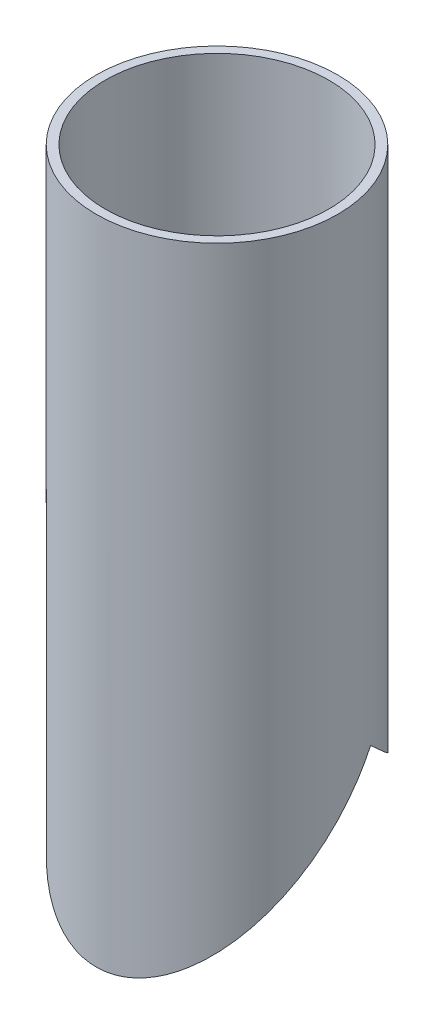
ISO-10303-21;
HEADER;
FILE_DESCRIPTION(('STEP AP214'),'2;1');
FILE_NAME('part.step','',(''),(''),'','','');
FILE_SCHEMA(('AUTOMOTIVE_DESIGN { 1 0 10303 214 1 1 1 1 }'));
ENDSEC;
DATA;
#1=APPLICATION_CONTEXT('core data for automotive mechanical design processes');
#2=APPLICATION_PROTOCOL_DEFINITION('international standard','automotive_design',2000,#1);
#3=PRODUCT_CONTEXT('',#1,'mechanical');
#4=PRODUCT('Part','Part','',(#3));
#5=PRODUCT_RELATED_PRODUCT_CATEGORY('part','',(#4));
#6=PRODUCT_DEFINITION_FORMATION('','',#4);
#7=PRODUCT_DEFINITION_CONTEXT('part definition',#1,'design');
#8=PRODUCT_DEFINITION('design','',#6,#7);
#9=PRODUCT_DEFINITION_SHAPE('','',#8);
#10=(LENGTH_UNIT() NAMED_UNIT(*) SI_UNIT(.MILLI.,.METRE.));
#11=(NAMED_UNIT(*) PLANE_ANGLE_UNIT() SI_UNIT($,.RADIAN.));
#12=(NAMED_UNIT(*) SI_UNIT($,.STERADIAN.) SOLID_ANGLE_UNIT());
#13=UNCERTAINTY_MEASURE_WITH_UNIT(LENGTH_MEASURE(1.E-05),#10,'distance_accuracy_value','');
#14=(GEOMETRIC_REPRESENTATION_CONTEXT(3) GLOBAL_UNCERTAINTY_ASSIGNED_CONTEXT((#13)) GLOBAL_UNIT_ASSIGNED_CONTEXT((#10,
#11,#12)) REPRESENTATION_CONTEXT('',''));
#15=CARTESIAN_POINT('',(0.,0.,0.));
#16=DIRECTION('',(0.,0.,1.));
#17=DIRECTION('',(1.,0.,0.));
#18=AXIS2_PLACEMENT_3D('',#15,#16,#17);
#19=CARTESIAN_POINT('',(0.,0.,0.));
#20=DIRECTION('',(0.,-1.,0.));
#21=DIRECTION('',(0.,0.,-1.));
#22=AXIS2_PLACEMENT_3D('',#19,#20,#21);
#23=CYLINDRICAL_SURFACE('',#22,22.225);
#24=CARTESIAN_POINT('',(0.,38.6546226433122,0.));
#25=DIRECTION('',(0.,0.725274725274725,-0.688459565172619));
#26=DIRECTION('',(0.,-0.688459565172619,-0.725274725274725));
#27=AXIS2_PLACEMENT_3D('',#24,#25,#26);
#28=ELLIPSE('',#27,30.6435606060606,22.225);
#29=CARTESIAN_POINT('',(-21.0009952448997,31.75,-7.27384518144986));
#30=VERTEX_POINT('',#29);
#31=CARTESIAN_POINT('',(21.0009952448997,31.75,-7.27384518144986));
#32=VERTEX_POINT('',#31);
#33=EDGE_CURVE('E11',#30,#32,#28,.F.);
#34=ORIENTED_EDGE('',*,*,#33,.F.);
#35=CARTESIAN_POINT('',(0.,24.0871882205687,0.));
#36=DIRECTION('',(0.,0.688459565172619,0.725274725274725));
#37=DIRECTION('',(0.,-0.725274725274725,0.688459565172619));
#38=AXIS2_PLACEMENT_3D('',#35,#36,#37);
#39=ELLIPSE('',#38,32.2822154332731,22.225);
#40=EDGE_CURVE('E41',#32,#30,#39,.F.);
#41=ORIENTED_EDGE('',*,*,#40,.F.);
#42=EDGE_LOOP('',(#34,#41));
#43=FACE_BOUND('',#42,.T.);
#44=CARTESIAN_POINT('',(0.,120.65,0.));
#45=DIRECTION('',(0.,-1.,0.));
#46=DIRECTION('',(0.,0.,-1.));
#47=AXIS2_PLACEMENT_3D('',#44,#45,#46);
#48=CIRCLE('',#47,22.225);
#49=CARTESIAN_POINT('',(0.,120.65,-22.225));
#50=VERTEX_POINT('',#49);
#51=EDGE_CURVE('E73',#50,#50,#48,.T.);
#52=ORIENTED_EDGE('',*,*,#51,.T.);
#53=EDGE_LOOP('',(#52));
#54=FACE_BOUND('',#53,.T.);
#55=ADVANCED_FACE('F33',(#43,#54),#23,.T.);
#56=CARTESIAN_POINT('',(0.,0.,0.));
#57=DIRECTION('',(0.,-1.,0.));
#58=DIRECTION('',(0.,0.,-1.));
#59=AXIS2_PLACEMENT_3D('',#56,#57,#58);
#60=CYLINDRICAL_SURFACE('',#59,20.574);
#61=CARTESIAN_POINT('',(0.,38.6546226433122,0.));
#62=DIRECTION('',(0.,0.725274725274725,-0.688459565172619));
#63=DIRECTION('',(0.,-0.688459565172619,-0.725274725274725));
#64=AXIS2_PLACEMENT_3D('',#61,#62,#63);
#65=ELLIPSE('',#64,28.3671818181818,20.574);
#66=CARTESIAN_POINT('',(19.2452761028856,31.75,-7.27384518144986));
#67=VERTEX_POINT('',#66);
#68=CARTESIAN_POINT('',(-19.2452761028856,31.75,-7.27384518144986));
#69=VERTEX_POINT('',#68);
#70=EDGE_CURVE('E66',#67,#69,#65,.T.);
#71=ORIENTED_EDGE('',*,*,#70,.F.);
#72=CARTESIAN_POINT('',(0.,24.0871882205687,0.));
#73=DIRECTION('',(0.,0.688459565172619,0.725274725274725));
#74=DIRECTION('',(0.,-0.725274725274725,0.688459565172619));
#75=AXIS2_PLACEMENT_3D('',#72,#73,#74);
#76=ELLIPSE('',#75,29.8841080010871,20.574);
#77=EDGE_CURVE('E68',#69,#67,#76,.T.);
#78=ORIENTED_EDGE('',*,*,#77,.F.);
#79=EDGE_LOOP('',(#71,#78));
#80=FACE_BOUND('',#79,.T.);
#81=CARTESIAN_POINT('',(0.,120.65,0.));
#82=DIRECTION('',(0.,-1.,0.));
#83=DIRECTION('',(0.,0.,-1.));
#84=AXIS2_PLACEMENT_3D('',#81,#82,#83);
#85=CIRCLE('',#84,20.574);
#86=CARTESIAN_POINT('',(0.,120.65,-20.574));
#87=VERTEX_POINT('',#86);
#88=EDGE_CURVE('E63',#87,#87,#85,.T.);
#89=ORIENTED_EDGE('',*,*,#88,.F.);
#90=EDGE_LOOP('',(#89));
#91=FACE_BOUND('',#90,.T.);
#92=ADVANCED_FACE('F35',(#80,#91),#60,.F.);
#93=CARTESIAN_POINT('',(0.,120.65,-20.574));
#94=DIRECTION('',(0.,1.,0.));
#95=DIRECTION('',(0.,0.,1.));
#96=AXIS2_PLACEMENT_3D('',#93,#94,#95);
#97=PLANE('',#96);
#98=ORIENTED_EDGE('',*,*,#88,.T.);
#99=EDGE_LOOP('',(#98));
#100=FACE_BOUND('',#99,.T.);
#101=ORIENTED_EDGE('',*,*,#51,.F.);
#102=EDGE_LOOP('',(#101));
#103=FACE_BOUND('',#102,.T.);
#104=ADVANCED_FACE('F79',(#100,#103),#97,.T.);
#105=CARTESIAN_POINT('',(-22.225,31.75,-7.27384518144986));
#106=DIRECTION('',(0.,0.725274725274725,-0.688459565172619));
#107=DIRECTION('',(0.,0.688459565172619,0.725274725274725));
#108=AXIS2_PLACEMENT_3D('',#105,#106,#107);
#109=PLANE('',#108);
#110=ORIENTED_EDGE('',*,*,#70,.T.);
#111=DIRECTION('',(1.,0.,0.));
#112=VECTOR('',#111,1.);
#113=CARTESIAN_POINT('',(-22.225,31.75,-7.27384518144986));
#114=LINE('',#113,#112);
#115=EDGE_CURVE('E48',#30,#69,#114,.T.);
#116=ORIENTED_EDGE('',*,*,#115,.F.);
#117=ORIENTED_EDGE('',*,*,#33,.T.);
#118=EDGE_CURVE('E62',#67,#32,#114,.T.);
#119=ORIENTED_EDGE('',*,*,#118,.F.);
#120=EDGE_LOOP('',(#110,#116,#117,#119));
#121=FACE_BOUND('',#120,.T.);
#122=ADVANCED_FACE('F64',(#121),#109,.F.);
#123=CARTESIAN_POINT('',(-22.225,0.673713290942046,22.225));
#124=DIRECTION('',(0.,0.688459565172619,0.725274725274725));
#125=DIRECTION('',(0.,-0.725274725274725,0.688459565172619));
#126=AXIS2_PLACEMENT_3D('',#123,#124,#125);
#127=PLANE('',#126);
#128=ORIENTED_EDGE('',*,*,#77,.T.);
#129=ORIENTED_EDGE('',*,*,#118,.T.);
#130=ORIENTED_EDGE('',*,*,#40,.T.);
#131=ORIENTED_EDGE('',*,*,#115,.T.);
#132=EDGE_LOOP('',(#128,#129,#130,#131));
#133=FACE_BOUND('',#132,.T.);
#134=ADVANCED_FACE('F61',(#133),#127,.F.);
#135=CLOSED_SHELL('',(#55,#92,#104,#122,#134));
#136=MANIFOLD_SOLID_BREP('B2',#135);
#137=ADVANCED_BREP_SHAPE_REPRESENTATION('',(#18,#136),#14);
#138=SHAPE_DEFINITION_REPRESENTATION(#9,#137);
ENDSEC;
END-ISO-10303-21;
